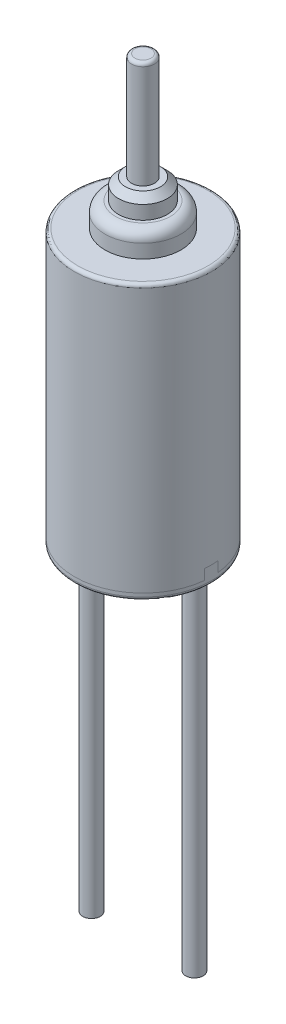
ISO-10303-21;
HEADER;
FILE_DESCRIPTION(('STEP AP214'),'2;1');
FILE_NAME('part.step','',(''),(''),'','','');
FILE_SCHEMA(('AUTOMOTIVE_DESIGN { 1 0 10303 214 1 1 1 1 }'));
ENDSEC;
DATA;
#1=APPLICATION_CONTEXT('core data for automotive mechanical design processes');
#2=APPLICATION_PROTOCOL_DEFINITION('international standard','automotive_design',2000,#1);
#3=PRODUCT_CONTEXT('',#1,'mechanical');
#4=PRODUCT('Part','Part','',(#3));
#5=PRODUCT_RELATED_PRODUCT_CATEGORY('part','',(#4));
#6=PRODUCT_DEFINITION_FORMATION('','',#4);
#7=PRODUCT_DEFINITION_CONTEXT('part definition',#1,'design');
#8=PRODUCT_DEFINITION('design','',#6,#7);
#9=PRODUCT_DEFINITION_SHAPE('','',#8);
#10=(LENGTH_UNIT() NAMED_UNIT(*) SI_UNIT(.MILLI.,.METRE.));
#11=(NAMED_UNIT(*) PLANE_ANGLE_UNIT() SI_UNIT($,.RADIAN.));
#12=(NAMED_UNIT(*) SI_UNIT($,.STERADIAN.) SOLID_ANGLE_UNIT());
#13=UNCERTAINTY_MEASURE_WITH_UNIT(LENGTH_MEASURE(1.E-05),#10,'distance_accuracy_value','');
#14=(GEOMETRIC_REPRESENTATION_CONTEXT(3) GLOBAL_UNCERTAINTY_ASSIGNED_CONTEXT((#13)) GLOBAL_UNIT_ASSIGNED_CONTEXT((#10,
#11,#12)) REPRESENTATION_CONTEXT('',''));
#15=CARTESIAN_POINT('',(0.,0.,0.));
#16=DIRECTION('',(0.,0.,1.));
#17=DIRECTION('',(1.,0.,0.));
#18=AXIS2_PLACEMENT_3D('',#15,#16,#17);
#19=CARTESIAN_POINT('',(1.5,-10.,0.));
#20=DIRECTION('',(0.,1.,0.));
#21=DIRECTION('',(0.,0.,1.));
#22=AXIS2_PLACEMENT_3D('',#19,#20,#21);
#23=CYLINDRICAL_SURFACE('',#22,0.255);
#24=CARTESIAN_POINT('',(1.5,-10.,0.));
#25=DIRECTION('',(0.,-1.,0.));
#26=DIRECTION('',(0.,0.,1.));
#27=AXIS2_PLACEMENT_3D('',#24,#25,#26);
#28=CIRCLE('',#27,0.255);
#29=CARTESIAN_POINT('',(1.5,-10.,0.255));
#30=VERTEX_POINT('',#29);
#31=EDGE_CURVE('E11',#30,#30,#28,.T.);
#32=ORIENTED_EDGE('',*,*,#31,.F.);
#33=EDGE_LOOP('',(#32));
#34=FACE_BOUND('',#33,.T.);
#35=CARTESIAN_POINT('',(1.5,0.,0.));
#36=DIRECTION('',(0.,-1.,0.));
#37=DIRECTION('',(0.,0.,1.));
#38=AXIS2_PLACEMENT_3D('',#35,#36,#37);
#39=CIRCLE('',#38,0.255);
#40=CARTESIAN_POINT('',(1.5,0.,0.255));
#41=VERTEX_POINT('',#40);
#42=EDGE_CURVE('E50',#41,#41,#39,.T.);
#43=ORIENTED_EDGE('',*,*,#42,.T.);
#44=EDGE_LOOP('',(#43));
#45=FACE_BOUND('',#44,.T.);
#46=ADVANCED_FACE('F47',(#34,#45),#23,.T.);
#47=CARTESIAN_POINT('',(1.5,-10.,0.));
#48=DIRECTION('',(0.,1.,0.));
#49=DIRECTION('',(0.,0.,1.));
#50=AXIS2_PLACEMENT_3D('',#47,#48,#49);
#51=PLANE('',#50);
#52=ORIENTED_EDGE('',*,*,#31,.T.);
#53=EDGE_LOOP('',(#52));
#54=FACE_BOUND('',#53,.T.);
#55=ADVANCED_FACE('F62',(#54),#51,.F.);
#56=CARTESIAN_POINT('',(1.5,0.,0.));
#57=DIRECTION('',(0.,1.,0.));
#58=DIRECTION('',(0.,0.,1.));
#59=AXIS2_PLACEMENT_3D('',#56,#57,#58);
#60=PLANE('',#59);
#61=ORIENTED_EDGE('',*,*,#42,.F.);
#62=EDGE_LOOP('',(#61));
#63=FACE_BOUND('',#62,.T.);
#64=ADVANCED_FACE('F60',(#63),#60,.T.);
#65=CLOSED_SHELL('',(#46,#55,#64));
#66=MANIFOLD_SOLID_BREP('B2',#65);
#67=CARTESIAN_POINT('',(-1.5,-10.,0.));
#68=DIRECTION('',(0.,1.,0.));
#69=DIRECTION('',(0.,0.,1.));
#70=AXIS2_PLACEMENT_3D('',#67,#68,#69);
#71=CYLINDRICAL_SURFACE('',#70,0.255);
#72=CARTESIAN_POINT('',(-1.5,-10.,0.));
#73=DIRECTION('',(0.,-1.,0.));
#74=DIRECTION('',(0.,0.,-1.));
#75=AXIS2_PLACEMENT_3D('',#72,#73,#74);
#76=CIRCLE('',#75,0.255);
#77=CARTESIAN_POINT('',(-1.5,-10.,-0.255));
#78=VERTEX_POINT('',#77);
#79=EDGE_CURVE('E46',#78,#78,#76,.T.);
#80=ORIENTED_EDGE('',*,*,#79,.F.);
#81=EDGE_LOOP('',(#80));
#82=FACE_BOUND('',#81,.T.);
#83=CARTESIAN_POINT('',(-1.5,0.,0.));
#84=DIRECTION('',(0.,-1.,0.));
#85=DIRECTION('',(0.,0.,-1.));
#86=AXIS2_PLACEMENT_3D('',#83,#84,#85);
#87=CIRCLE('',#86,0.255);
#88=CARTESIAN_POINT('',(-1.5,0.,-0.255));
#89=VERTEX_POINT('',#88);
#90=EDGE_CURVE('E118',#89,#89,#87,.T.);
#91=ORIENTED_EDGE('',*,*,#90,.T.);
#92=EDGE_LOOP('',(#91));
#93=FACE_BOUND('',#92,.T.);
#94=ADVANCED_FACE('F115',(#82,#93),#71,.T.);
#95=CARTESIAN_POINT('',(-1.5,-10.,0.));
#96=DIRECTION('',(0.,-1.,0.));
#97=DIRECTION('',(0.,0.,-1.));
#98=AXIS2_PLACEMENT_3D('',#95,#96,#97);
#99=PLANE('',#98);
#100=ORIENTED_EDGE('',*,*,#79,.T.);
#101=EDGE_LOOP('',(#100));
#102=FACE_BOUND('',#101,.T.);
#103=ADVANCED_FACE('F130',(#102),#99,.T.);
#104=CARTESIAN_POINT('',(-1.5,0.,0.));
#105=DIRECTION('',(0.,-1.,0.));
#106=DIRECTION('',(0.,0.,-1.));
#107=AXIS2_PLACEMENT_3D('',#104,#105,#106);
#108=PLANE('',#107);
#109=ORIENTED_EDGE('',*,*,#90,.F.);
#110=EDGE_LOOP('',(#109));
#111=FACE_BOUND('',#110,.T.);
#112=ADVANCED_FACE('F128',(#111),#108,.F.);
#113=CLOSED_SHELL('',(#94,#103,#112));
#114=MANIFOLD_SOLID_BREP('B6',#113);
#115=CARTESIAN_POINT('',(-2.01,0.2,-2.));
#116=DIRECTION('',(0.,1.,0.));
#117=DIRECTION('',(0.,0.,1.));
#118=AXIS2_PLACEMENT_3D('',#115,#116,#117);
#119=PLANE('',#118);
#120=DIRECTION('',(1.,0.,0.));
#121=VECTOR('',#120,1.);
#122=CARTESIAN_POINT('',(-2.01,0.2,-0.2));
#123=LINE('',#122,#121);
#124=CARTESIAN_POINT('',(-1.98997487421324,0.2,-0.2));
#125=VERTEX_POINT('',#124);
#126=CARTESIAN_POINT('',(1.98997487421324,0.2,-0.2));
#127=VERTEX_POINT('',#126);
#128=EDGE_CURVE('E198',#125,#127,#123,.T.);
#129=ORIENTED_EDGE('',*,*,#128,.T.);
#130=CARTESIAN_POINT('',(0.,0.2,0.));
#131=DIRECTION('',(0.,1.,0.));
#132=DIRECTION('',(0.,0.,1.));
#133=AXIS2_PLACEMENT_3D('',#130,#131,#132);
#134=CIRCLE('',#133,2.);
#135=EDGE_CURVE('E253',#127,#125,#134,.T.);
#136=ORIENTED_EDGE('',*,*,#135,.T.);
#137=EDGE_LOOP('',(#129,#136));
#138=FACE_BOUND('',#137,.T.);
#139=ADVANCED_FACE('F183',(#138),#119,.T.);
#140=CARTESIAN_POINT('',(-2.01,0.2,-0.2));
#141=DIRECTION('',(0.,0.,-1.));
#142=DIRECTION('',(0.,1.,0.));
#143=AXIS2_PLACEMENT_3D('',#140,#141,#142);
#144=PLANE('',#143);
#145=DIRECTION('',(1.,0.,0.));
#146=VECTOR('',#145,1.);
#147=CARTESIAN_POINT('',(-2.01,0.5,-0.2));
#148=LINE('',#147,#146);
#149=CARTESIAN_POINT('',(-1.98997487421324,0.5,-0.199999999999997));
#150=VERTEX_POINT('',#149);
#151=CARTESIAN_POINT('',(1.98997487421324,0.5,-0.199999999999997));
#152=VERTEX_POINT('',#151);
#153=EDGE_CURVE('E257',#150,#152,#148,.T.);
#154=ORIENTED_EDGE('',*,*,#153,.T.);
#155=DIRECTION('',(0.,-1.,0.));
#156=VECTOR('',#155,1.);
#157=CARTESIAN_POINT('',(1.98997487421324,8.,-0.199999999999997));
#158=LINE('',#157,#156);
#159=EDGE_CURVE('E249',#152,#127,#158,.T.);
#160=ORIENTED_EDGE('',*,*,#159,.T.);
#161=ORIENTED_EDGE('',*,*,#128,.F.);
#162=DIRECTION('',(0.,-1.,0.));
#163=VECTOR('',#162,1.);
#164=CARTESIAN_POINT('',(-1.98997487421324,8.,-0.199999999999997));
#165=LINE('',#164,#163);
#166=EDGE_CURVE('E251',#125,#150,#165,.F.);
#167=ORIENTED_EDGE('',*,*,#166,.T.);
#168=EDGE_LOOP('',(#154,#160,#161,#167));
#169=FACE_BOUND('',#168,.T.);
#170=ADVANCED_FACE('F265',(#169),#144,.T.);
#171=CARTESIAN_POINT('',(-2.01,0.5,0.2));
#172=DIRECTION('',(0.,1.,0.));
#173=DIRECTION('',(0.,0.,1.));
#174=AXIS2_PLACEMENT_3D('',#171,#172,#173);
#175=PLANE('',#174);
#176=DIRECTION('',(1.,0.,0.));
#177=VECTOR('',#176,1.);
#178=CARTESIAN_POINT('',(-2.01,0.5,0.2));
#179=LINE('',#178,#177);
#180=CARTESIAN_POINT('',(-1.98997487421324,0.5,0.2));
#181=VERTEX_POINT('',#180);
#182=CARTESIAN_POINT('',(1.98997487421324,0.5,0.2));
#183=VERTEX_POINT('',#182);
#184=EDGE_CURVE('E230',#181,#183,#179,.T.);
#185=ORIENTED_EDGE('',*,*,#184,.T.);
#186=CARTESIAN_POINT('',(0.,0.5,0.));
#187=DIRECTION('',(0.,1.,0.));
#188=DIRECTION('',(0.,0.,1.));
#189=AXIS2_PLACEMENT_3D('',#186,#187,#188);
#190=CIRCLE('',#189,2.);
#191=EDGE_CURVE('E246',#183,#152,#190,.T.);
#192=ORIENTED_EDGE('',*,*,#191,.T.);
#193=ORIENTED_EDGE('',*,*,#153,.F.);
#194=EDGE_CURVE('E247',#150,#181,#190,.T.);
#195=ORIENTED_EDGE('',*,*,#194,.T.);
#196=EDGE_LOOP('',(#185,#192,#193,#195));
#197=FACE_BOUND('',#196,.T.);
#198=ADVANCED_FACE('F262',(#197),#175,.T.);
#199=CARTESIAN_POINT('',(-2.01,0.2,0.2));
#200=DIRECTION('',(0.,0.,1.));
#201=DIRECTION('',(0.,-1.,0.));
#202=AXIS2_PLACEMENT_3D('',#199,#200,#201);
#203=PLANE('',#202);
#204=ORIENTED_EDGE('',*,*,#184,.F.);
#205=DIRECTION('',(0.,-1.,0.));
#206=VECTOR('',#205,1.);
#207=CARTESIAN_POINT('',(-1.98997487421324,8.,0.199999999999999));
#208=LINE('',#207,#206);
#209=CARTESIAN_POINT('',(-1.98997487421324,0.2,0.199999999999999));
#210=VERTEX_POINT('',#209);
#211=EDGE_CURVE('E233',#181,#210,#208,.T.);
#212=ORIENTED_EDGE('',*,*,#211,.T.);
#213=DIRECTION('',(1.,0.,0.));
#214=VECTOR('',#213,1.);
#215=CARTESIAN_POINT('',(-2.01,0.2,0.2));
#216=LINE('',#215,#214);
#217=CARTESIAN_POINT('',(1.98997487421324,0.2,0.199999999999999));
#218=VERTEX_POINT('',#217);
#219=EDGE_CURVE('E222',#210,#218,#216,.T.);
#220=ORIENTED_EDGE('',*,*,#219,.T.);
#221=DIRECTION('',(0.,-1.,0.));
#222=VECTOR('',#221,1.);
#223=CARTESIAN_POINT('',(1.98997487421324,8.,0.199999999999999));
#224=LINE('',#223,#222);
#225=EDGE_CURVE('E238',#218,#183,#224,.F.);
#226=ORIENTED_EDGE('',*,*,#225,.T.);
#227=EDGE_LOOP('',(#204,#212,#220,#226));
#228=FACE_BOUND('',#227,.T.);
#229=ADVANCED_FACE('F234',(#228),#203,.T.);
#230=CARTESIAN_POINT('',(-2.01,0.2,2.));
#231=DIRECTION('',(0.,1.,0.));
#232=DIRECTION('',(0.,0.,1.));
#233=AXIS2_PLACEMENT_3D('',#230,#231,#232);
#234=PLANE('',#233);
#235=CARTESIAN_POINT('',(0.,0.2,0.));
#236=DIRECTION('',(0.,1.,0.));
#237=DIRECTION('',(0.,0.,1.));
#238=AXIS2_PLACEMENT_3D('',#235,#236,#237);
#239=CIRCLE('',#238,2.);
#240=EDGE_CURVE('E226',#210,#218,#239,.T.);
#241=ORIENTED_EDGE('',*,*,#240,.T.);
#242=ORIENTED_EDGE('',*,*,#219,.F.);
#243=EDGE_LOOP('',(#241,#242));
#244=FACE_BOUND('',#243,.T.);
#245=ADVANCED_FACE('F224',(#244),#234,.T.);
#246=CARTESIAN_POINT('',(0.,8.,0.));
#247=DIRECTION('',(0.,-1.,0.));
#248=DIRECTION('',(0.,0.,-1.));
#249=AXIS2_PLACEMENT_3D('',#246,#247,#248);
#250=CYLINDRICAL_SURFACE('',#249,2.);
#251=CARTESIAN_POINT('',(0.,0.0999999999999994,0.));
#252=DIRECTION('',(0.,1.,0.));
#253=DIRECTION('',(0.,0.,1.));
#254=AXIS2_PLACEMENT_3D('',#251,#252,#253);
#255=CIRCLE('',#254,2.);
#256=CARTESIAN_POINT('',(0.,0.0999999999999994,2.));
#257=VERTEX_POINT('',#256);
#258=EDGE_CURVE('E191',#257,#257,#255,.T.);
#259=ORIENTED_EDGE('',*,*,#258,.T.);
#260=EDGE_LOOP('',(#259));
#261=FACE_BOUND('',#260,.T.);
#262=ORIENTED_EDGE('',*,*,#225,.F.);
#263=ORIENTED_EDGE('',*,*,#240,.F.);
#264=ORIENTED_EDGE('',*,*,#211,.F.);
#265=ORIENTED_EDGE('',*,*,#194,.F.);
#266=ORIENTED_EDGE('',*,*,#166,.F.);
#267=ORIENTED_EDGE('',*,*,#135,.F.);
#268=ORIENTED_EDGE('',*,*,#159,.F.);
#269=ORIENTED_EDGE('',*,*,#191,.F.);
#270=EDGE_LOOP('',(#262,#263,#264,#265,#266,#267,#268,#269));
#271=FACE_BOUND('',#270,.T.);
#272=ADVANCED_FACE('F240',(#261,#271),#250,.T.);
#273=CARTESIAN_POINT('',(0.,0.,0.));
#274=DIRECTION('',(0.,1.,0.));
#275=DIRECTION('',(0.,0.,1.));
#276=AXIS2_PLACEMENT_3D('',#273,#274,#275);
#277=PLANE('',#276);
#278=CARTESIAN_POINT('',(0.,0.,0.));
#279=DIRECTION('',(0.,1.,0.));
#280=DIRECTION('',(0.,0.,1.));
#281=AXIS2_PLACEMENT_3D('',#278,#279,#280);
#282=CIRCLE('',#281,1.9);
#283=CARTESIAN_POINT('',(0.,0.,1.9));
#284=VERTEX_POINT('',#283);
#285=EDGE_CURVE('E113',#284,#284,#282,.F.);
#286=ORIENTED_EDGE('',*,*,#285,.T.);
#287=EDGE_LOOP('',(#286));
#288=FACE_BOUND('',#287,.T.);
#289=ADVANCED_FACE('F275',(#288),#277,.F.);
#290=CARTESIAN_POINT('',(0.,0.0999999999999994,0.));
#291=DIRECTION('',(0.,1.,0.));
#292=DIRECTION('',(0.,0.,1.));
#293=AXIS2_PLACEMENT_3D('',#290,#291,#292);
#294=TOROIDAL_SURFACE('',#293,1.9,0.1);
#295=ORIENTED_EDGE('',*,*,#285,.F.);
#296=EDGE_LOOP('',(#295));
#297=FACE_BOUND('',#296,.T.);
#298=ORIENTED_EDGE('',*,*,#258,.F.);
#299=EDGE_LOOP('',(#298));
#300=FACE_BOUND('',#299,.T.);
#301=ADVANCED_FACE('F185',(#297,#300),#294,.T.);
#302=CLOSED_SHELL('',(#139,#170,#198,#229,#245,#272,#289,#301));
#303=MANIFOLD_SOLID_BREP('B41',#302);
#304=CARTESIAN_POINT('',(-2.01,0.2,-2.));
#305=DIRECTION('',(0.,1.,0.));
#306=DIRECTION('',(0.,0.,1.));
#307=AXIS2_PLACEMENT_3D('',#304,#305,#306);
#308=PLANE('',#307);
#309=DIRECTION('',(1.,0.,0.));
#310=VECTOR('',#309,1.);
#311=CARTESIAN_POINT('',(-2.01,0.2,-0.2));
#312=LINE('',#311,#310);
#313=CARTESIAN_POINT('',(-1.98997487421324,0.2,-0.2));
#314=VERTEX_POINT('',#313);
#315=CARTESIAN_POINT('',(1.98997487421324,0.2,-0.2));
#316=VERTEX_POINT('',#315);
#317=EDGE_CURVE('E403',#314,#316,#312,.T.);
#318=ORIENTED_EDGE('',*,*,#317,.F.);
#319=CARTESIAN_POINT('',(0.,0.2,0.));
#320=DIRECTION('',(0.,1.,0.));
#321=DIRECTION('',(0.,0.,1.));
#322=AXIS2_PLACEMENT_3D('',#319,#320,#321);
#323=CIRCLE('',#322,2.);
#324=EDGE_CURVE('E358',#316,#314,#323,.T.);
#325=ORIENTED_EDGE('',*,*,#324,.F.);
#326=EDGE_LOOP('',(#318,#325));
#327=FACE_BOUND('',#326,.T.);
#328=ADVANCED_FACE('F343',(#327),#308,.F.);
#329=CARTESIAN_POINT('',(-2.01,0.2,-0.2));
#330=DIRECTION('',(0.,0.,-1.));
#331=DIRECTION('',(0.,1.,0.));
#332=AXIS2_PLACEMENT_3D('',#329,#330,#331);
#333=PLANE('',#332);
#334=DIRECTION('',(1.,0.,0.));
#335=VECTOR('',#334,1.);
#336=CARTESIAN_POINT('',(-2.01,0.5,-0.2));
#337=LINE('',#336,#335);
#338=CARTESIAN_POINT('',(-1.98997487421324,0.5,-0.199999999999997));
#339=VERTEX_POINT('',#338);
#340=CARTESIAN_POINT('',(1.98997487421324,0.5,-0.199999999999997));
#341=VERTEX_POINT('',#340);
#342=EDGE_CURVE('E407',#339,#341,#337,.T.);
#343=ORIENTED_EDGE('',*,*,#342,.F.);
#344=DIRECTION('',(0.,-1.,0.));
#345=VECTOR('',#344,1.);
#346=CARTESIAN_POINT('',(-1.98997487421324,8.,-0.199999999999997));
#347=LINE('',#346,#345);
#348=EDGE_CURVE('E467',#314,#339,#347,.F.);
#349=ORIENTED_EDGE('',*,*,#348,.F.);
#350=ORIENTED_EDGE('',*,*,#317,.T.);
#351=DIRECTION('',(0.,-1.,0.));
#352=VECTOR('',#351,1.);
#353=CARTESIAN_POINT('',(1.98997487421324,8.,-0.199999999999997));
#354=LINE('',#353,#352);
#355=EDGE_CURVE('E471',#341,#316,#354,.T.);
#356=ORIENTED_EDGE('',*,*,#355,.F.);
#357=EDGE_LOOP('',(#343,#349,#350,#356));
#358=FACE_BOUND('',#357,.T.);
#359=ADVANCED_FACE('F429',(#358),#333,.F.);
#360=CARTESIAN_POINT('',(-2.01,0.5,0.2));
#361=DIRECTION('',(0.,1.,0.));
#362=DIRECTION('',(0.,0.,1.));
#363=AXIS2_PLACEMENT_3D('',#360,#361,#362);
#364=PLANE('',#363);
#365=DIRECTION('',(1.,0.,0.));
#366=VECTOR('',#365,1.);
#367=CARTESIAN_POINT('',(-2.01,0.5,0.2));
#368=LINE('',#367,#366);
#369=CARTESIAN_POINT('',(-1.98997487421324,0.5,0.2));
#370=VERTEX_POINT('',#369);
#371=CARTESIAN_POINT('',(1.98997487421324,0.5,0.2));
#372=VERTEX_POINT('',#371);
#373=EDGE_CURVE('E397',#370,#372,#368,.T.);
#374=ORIENTED_EDGE('',*,*,#373,.F.);
#375=CARTESIAN_POINT('',(0.,0.5,0.));
#376=DIRECTION('',(0.,1.,0.));
#377=DIRECTION('',(0.,0.,1.));
#378=AXIS2_PLACEMENT_3D('',#375,#376,#377);
#379=CIRCLE('',#378,2.);
#380=EDGE_CURVE('E387',#339,#370,#379,.T.);
#381=ORIENTED_EDGE('',*,*,#380,.F.);
#382=ORIENTED_EDGE('',*,*,#342,.T.);
#383=EDGE_CURVE('E473',#372,#341,#379,.T.);
#384=ORIENTED_EDGE('',*,*,#383,.F.);
#385=EDGE_LOOP('',(#374,#381,#382,#384));
#386=FACE_BOUND('',#385,.T.);
#387=ADVANCED_FACE('F434',(#386),#364,.F.);
#388=CARTESIAN_POINT('',(-2.01,0.2,0.2));
#389=DIRECTION('',(0.,0.,1.));
#390=DIRECTION('',(0.,-1.,0.));
#391=AXIS2_PLACEMENT_3D('',#388,#389,#390);
#392=PLANE('',#391);
#393=ORIENTED_EDGE('',*,*,#373,.T.);
#394=DIRECTION('',(0.,-1.,0.));
#395=VECTOR('',#394,1.);
#396=CARTESIAN_POINT('',(1.98997487421324,8.,0.199999999999999));
#397=LINE('',#396,#395);
#398=CARTESIAN_POINT('',(1.98997487421324,0.2,0.199999999999999));
#399=VERTEX_POINT('',#398);
#400=EDGE_CURVE('E391',#399,#372,#397,.F.);
#401=ORIENTED_EDGE('',*,*,#400,.F.);
#402=DIRECTION('',(1.,0.,0.));
#403=VECTOR('',#402,1.);
#404=CARTESIAN_POINT('',(-2.01,0.2,0.2));
#405=LINE('',#404,#403);
#406=CARTESIAN_POINT('',(-1.98997487421324,0.2,0.199999999999999));
#407=VERTEX_POINT('',#406);
#408=EDGE_CURVE('E394',#407,#399,#405,.T.);
#409=ORIENTED_EDGE('',*,*,#408,.F.);
#410=DIRECTION('',(0.,-1.,0.));
#411=VECTOR('',#410,1.);
#412=CARTESIAN_POINT('',(-1.98997487421324,8.,0.199999999999999));
#413=LINE('',#412,#411);
#414=EDGE_CURVE('E380',#370,#407,#413,.T.);
#415=ORIENTED_EDGE('',*,*,#414,.F.);
#416=EDGE_LOOP('',(#393,#401,#409,#415));
#417=FACE_BOUND('',#416,.T.);
#418=ADVANCED_FACE('F395',(#417),#392,.F.);
#419=CARTESIAN_POINT('',(-2.01,0.2,2.));
#420=DIRECTION('',(0.,1.,0.));
#421=DIRECTION('',(0.,0.,1.));
#422=AXIS2_PLACEMENT_3D('',#419,#420,#421);
#423=PLANE('',#422);
#424=CARTESIAN_POINT('',(0.,0.2,0.));
#425=DIRECTION('',(0.,1.,0.));
#426=DIRECTION('',(0.,0.,1.));
#427=AXIS2_PLACEMENT_3D('',#424,#425,#426);
#428=CIRCLE('',#427,2.);
#429=EDGE_CURVE('E385',#407,#399,#428,.T.);
#430=ORIENTED_EDGE('',*,*,#429,.F.);
#431=ORIENTED_EDGE('',*,*,#408,.T.);
#432=EDGE_LOOP('',(#430,#431));
#433=FACE_BOUND('',#432,.T.);
#434=ADVANCED_FACE('F399',(#433),#423,.F.);
#435=CARTESIAN_POINT('',(0.,8.7,0.));
#436=DIRECTION('',(0.,1.,0.));
#437=DIRECTION('',(0.,0.,1.));
#438=AXIS2_PLACEMENT_3D('',#435,#436,#437);
#439=PLANE('',#438);
#440=CARTESIAN_POINT('',(0.,8.7,0.));
#441=DIRECTION('',(0.,1.,0.));
#442=DIRECTION('',(0.,0.,1.));
#443=AXIS2_PLACEMENT_3D('',#440,#441,#442);
#444=CIRCLE('',#443,0.805);
#445=CARTESIAN_POINT('',(0.,8.7,0.805));
#446=VERTEX_POINT('',#445);
#447=EDGE_CURVE('E351',#446,#446,#444,.T.);
#448=ORIENTED_EDGE('',*,*,#447,.T.);
#449=EDGE_LOOP('',(#448));
#450=FACE_BOUND('',#449,.T.);
#451=ADVANCED_FACE('F418',(#450),#439,.T.);
#452=CARTESIAN_POINT('',(0.,8.7,0.));
#453=DIRECTION('',(0.,-1.,0.));
#454=DIRECTION('',(0.,0.,-1.));
#455=AXIS2_PLACEMENT_3D('',#452,#453,#454);
#456=CYLINDRICAL_SURFACE('',#455,1.105);
#457=CARTESIAN_POINT('',(0.,8.4,0.));
#458=DIRECTION('',(0.,1.,0.));
#459=DIRECTION('',(0.,0.,1.));
#460=AXIS2_PLACEMENT_3D('',#457,#458,#459);
#461=CIRCLE('',#460,1.105);
#462=CARTESIAN_POINT('',(0.,8.4,1.105));
#463=VERTEX_POINT('',#462);
#464=EDGE_CURVE('E181',#463,#463,#461,.F.);
#465=ORIENTED_EDGE('',*,*,#464,.T.);
#466=EDGE_LOOP('',(#465));
#467=FACE_BOUND('',#466,.T.);
#468=CARTESIAN_POINT('',(0.,8.,0.));
#469=DIRECTION('',(0.,1.,0.));
#470=DIRECTION('',(0.,0.,1.));
#471=AXIS2_PLACEMENT_3D('',#468,#469,#470);
#472=CIRCLE('',#471,1.105);
#473=CARTESIAN_POINT('',(0.,8.,1.105));
#474=VERTEX_POINT('',#473);
#475=EDGE_CURVE('E464',#474,#474,#472,.T.);
#476=ORIENTED_EDGE('',*,*,#475,.T.);
#477=EDGE_LOOP('',(#476));
#478=FACE_BOUND('',#477,.T.);
#479=ADVANCED_FACE('F449',(#467,#478),#456,.T.);
#480=CARTESIAN_POINT('',(0.,8.,0.));
#481=DIRECTION('',(0.,1.,0.));
#482=DIRECTION('',(0.,0.,1.));
#483=AXIS2_PLACEMENT_3D('',#480,#481,#482);
#484=PLANE('',#483);
#485=CARTESIAN_POINT('',(0.,8.,0.));
#486=DIRECTION('',(0.,1.,0.));
#487=DIRECTION('',(0.,0.,1.));
#488=AXIS2_PLACEMENT_3D('',#485,#486,#487);
#489=CIRCLE('',#488,1.9);
#490=CARTESIAN_POINT('',(0.,8.,1.9));
#491=VERTEX_POINT('',#490);
#492=EDGE_CURVE('E406',#491,#491,#489,.T.);
#493=ORIENTED_EDGE('',*,*,#492,.T.);
#494=EDGE_LOOP('',(#493));
#495=FACE_BOUND('',#494,.T.);
#496=ORIENTED_EDGE('',*,*,#475,.F.);
#497=EDGE_LOOP('',(#496));
#498=FACE_BOUND('',#497,.T.);
#499=ADVANCED_FACE('F452',(#495,#498),#484,.T.);
#500=CARTESIAN_POINT('',(0.,8.,0.));
#501=DIRECTION('',(0.,-1.,0.));
#502=DIRECTION('',(0.,0.,-1.));
#503=AXIS2_PLACEMENT_3D('',#500,#501,#502);
#504=CYLINDRICAL_SURFACE('',#503,2.);
#505=CARTESIAN_POINT('',(0.,7.9,0.));
#506=DIRECTION('',(0.,1.,0.));
#507=DIRECTION('',(0.,0.,1.));
#508=AXIS2_PLACEMENT_3D('',#505,#506,#507);
#509=CIRCLE('',#508,2.);
#510=CARTESIAN_POINT('',(0.,7.9,2.));
#511=VERTEX_POINT('',#510);
#512=EDGE_CURVE('E413',#511,#511,#509,.F.);
#513=ORIENTED_EDGE('',*,*,#512,.T.);
#514=EDGE_LOOP('',(#513));
#515=FACE_BOUND('',#514,.T.);
#516=ORIENTED_EDGE('',*,*,#429,.T.);
#517=ORIENTED_EDGE('',*,*,#400,.T.);
#518=ORIENTED_EDGE('',*,*,#383,.T.);
#519=ORIENTED_EDGE('',*,*,#355,.T.);
#520=ORIENTED_EDGE('',*,*,#324,.T.);
#521=ORIENTED_EDGE('',*,*,#348,.T.);
#522=ORIENTED_EDGE('',*,*,#380,.T.);
#523=ORIENTED_EDGE('',*,*,#414,.T.);
#524=EDGE_LOOP('',(#516,#517,#518,#519,#520,#521,#522,#523));
#525=FACE_BOUND('',#524,.T.);
#526=ADVANCED_FACE('F382',(#515,#525),#504,.T.);
#527=CARTESIAN_POINT('',(0.,7.9,0.));
#528=DIRECTION('',(0.,1.,0.));
#529=DIRECTION('',(0.,0.,1.));
#530=AXIS2_PLACEMENT_3D('',#527,#528,#529);
#531=TOROIDAL_SURFACE('',#530,1.9,0.1);
#532=ORIENTED_EDGE('',*,*,#512,.F.);
#533=EDGE_LOOP('',(#532));
#534=FACE_BOUND('',#533,.T.);
#535=ORIENTED_EDGE('',*,*,#492,.F.);
#536=EDGE_LOOP('',(#535));
#537=FACE_BOUND('',#536,.T.);
#538=ADVANCED_FACE('F421',(#534,#537),#531,.T.);
#539=CARTESIAN_POINT('',(0.,8.4,0.));
#540=DIRECTION('',(0.,1.,0.));
#541=DIRECTION('',(0.,0.,1.));
#542=AXIS2_PLACEMENT_3D('',#539,#540,#541);
#543=TOROIDAL_SURFACE('',#542,0.805,0.3);
#544=ORIENTED_EDGE('',*,*,#464,.F.);
#545=EDGE_LOOP('',(#544));
#546=FACE_BOUND('',#545,.T.);
#547=ORIENTED_EDGE('',*,*,#447,.F.);
#548=EDGE_LOOP('',(#547));
#549=FACE_BOUND('',#548,.T.);
#550=ADVANCED_FACE('F345',(#546,#549),#543,.T.);
#551=CLOSED_SHELL('',(#328,#359,#387,#418,#434,#451,#479,#499,#526,#538,#550));
#552=MANIFOLD_SOLID_BREP('B107',#551);
#553=CARTESIAN_POINT('',(0.,12.41,0.));
#554=DIRECTION('',(0.,-1.,0.));
#555=DIRECTION('',(0.,0.,-1.));
#556=AXIS2_PLACEMENT_3D('',#553,#554,#555);
#557=CYLINDRICAL_SURFACE('',#556,0.335);
#558=CARTESIAN_POINT('',(0.,12.31,0.));
#559=DIRECTION('',(0.,1.,0.));
#560=DIRECTION('',(0.,0.,1.));
#561=AXIS2_PLACEMENT_3D('',#558,#559,#560);
#562=CIRCLE('',#561,0.335);
#563=CARTESIAN_POINT('',(0.,12.31,0.335));
#564=VERTEX_POINT('',#563);
#565=EDGE_CURVE('E342',#564,#564,#562,.F.);
#566=ORIENTED_EDGE('',*,*,#565,.T.);
#567=EDGE_LOOP('',(#566));
#568=FACE_BOUND('',#567,.T.);
#569=CARTESIAN_POINT('',(0.,9.3,0.));
#570=DIRECTION('',(0.,1.,0.));
#571=DIRECTION('',(0.,0.,1.));
#572=AXIS2_PLACEMENT_3D('',#569,#570,#571);
#573=CIRCLE('',#572,0.335);
#574=CARTESIAN_POINT('',(0.,9.3,0.335));
#575=VERTEX_POINT('',#574);
#576=EDGE_CURVE('E558',#575,#575,#573,.T.);
#577=ORIENTED_EDGE('',*,*,#576,.T.);
#578=EDGE_LOOP('',(#577));
#579=FACE_BOUND('',#578,.T.);
#580=ADVANCED_FACE('F547',(#568,#579),#557,.T.);
#581=CARTESIAN_POINT('',(0.,12.41,0.));
#582=DIRECTION('',(0.,1.,0.));
#583=DIRECTION('',(0.,0.,1.));
#584=AXIS2_PLACEMENT_3D('',#581,#582,#583);
#585=PLANE('',#584);
#586=CARTESIAN_POINT('',(0.,12.41,0.));
#587=DIRECTION('',(0.,1.,0.));
#588=DIRECTION('',(0.,0.,1.));
#589=AXIS2_PLACEMENT_3D('',#586,#587,#588);
#590=CIRCLE('',#589,0.235);
#591=CARTESIAN_POINT('',(0.,12.41,0.235));
#592=VERTEX_POINT('',#591);
#593=EDGE_CURVE('E554',#592,#592,#590,.T.);
#594=ORIENTED_EDGE('',*,*,#593,.T.);
#595=EDGE_LOOP('',(#594));
#596=FACE_BOUND('',#595,.T.);
#597=ADVANCED_FACE('F568',(#596),#585,.T.);
#598=CARTESIAN_POINT('',(0.,9.3,0.));
#599=DIRECTION('',(0.,1.,0.));
#600=DIRECTION('',(0.,0.,1.));
#601=AXIS2_PLACEMENT_3D('',#598,#599,#600);
#602=PLANE('',#601);
#603=ORIENTED_EDGE('',*,*,#576,.F.);
#604=EDGE_LOOP('',(#603));
#605=FACE_BOUND('',#604,.T.);
#606=ADVANCED_FACE('F566',(#605),#602,.F.);
#607=CARTESIAN_POINT('',(0.,12.31,0.));
#608=DIRECTION('',(0.,1.,0.));
#609=DIRECTION('',(0.,0.,1.));
#610=AXIS2_PLACEMENT_3D('',#607,#608,#609);
#611=TOROIDAL_SURFACE('',#610,0.235,0.1);
#612=ORIENTED_EDGE('',*,*,#565,.F.);
#613=EDGE_LOOP('',(#612));
#614=FACE_BOUND('',#613,.T.);
#615=ORIENTED_EDGE('',*,*,#593,.F.);
#616=EDGE_LOOP('',(#615));
#617=FACE_BOUND('',#616,.T.);
#618=ADVANCED_FACE('F549',(#614,#617),#611,.T.);
#619=CLOSED_SHELL('',(#580,#597,#606,#618));
#620=MANIFOLD_SOLID_BREP('B175',#619);
#621=CARTESIAN_POINT('',(0.,9.3,0.));
#622=DIRECTION('',(0.,-1.,0.));
#623=DIRECTION('',(0.,0.,-1.));
#624=AXIS2_PLACEMENT_3D('',#621,#622,#623);
#625=CYLINDRICAL_SURFACE('',#624,0.71);
#626=CARTESIAN_POINT('',(0.,9.1,0.));
#627=DIRECTION('',(0.,1.,0.));
#628=DIRECTION('',(0.,0.,1.));
#629=AXIS2_PLACEMENT_3D('',#626,#627,#628);
#630=CIRCLE('',#629,0.71);
#631=CARTESIAN_POINT('',(0.,9.1,0.71));
#632=VERTEX_POINT('',#631);
#633=EDGE_CURVE('E546',#632,#632,#630,.F.);
#634=ORIENTED_EDGE('',*,*,#633,.T.);
#635=EDGE_LOOP('',(#634));
#636=FACE_BOUND('',#635,.T.);
#637=CARTESIAN_POINT('',(0.,8.7,0.));
#638=DIRECTION('',(0.,1.,0.));
#639=DIRECTION('',(0.,0.,1.));
#640=AXIS2_PLACEMENT_3D('',#637,#638,#639);
#641=CIRCLE('',#640,0.71);
#642=CARTESIAN_POINT('',(0.,8.7,0.71));
#643=VERTEX_POINT('',#642);
#644=EDGE_CURVE('E613',#643,#643,#641,.T.);
#645=ORIENTED_EDGE('',*,*,#644,.T.);
#646=EDGE_LOOP('',(#645));
#647=FACE_BOUND('',#646,.T.);
#648=ADVANCED_FACE('F602',(#636,#647),#625,.T.);
#649=CARTESIAN_POINT('',(0.,9.3,0.));
#650=DIRECTION('',(0.,1.,0.));
#651=DIRECTION('',(0.,0.,1.));
#652=AXIS2_PLACEMENT_3D('',#649,#650,#651);
#653=PLANE('',#652);
#654=CARTESIAN_POINT('',(0.,9.3,0.));
#655=DIRECTION('',(0.,1.,0.));
#656=DIRECTION('',(0.,0.,1.));
#657=AXIS2_PLACEMENT_3D('',#654,#655,#656);
#658=CIRCLE('',#657,0.509999999999999);
#659=CARTESIAN_POINT('',(0.,9.3,0.509999999999999));
#660=VERTEX_POINT('',#659);
#661=EDGE_CURVE('E609',#660,#660,#658,.T.);
#662=ORIENTED_EDGE('',*,*,#661,.T.);
#663=EDGE_LOOP('',(#662));
#664=FACE_BOUND('',#663,.T.);
#665=ADVANCED_FACE('F623',(#664),#653,.T.);
#666=CARTESIAN_POINT('',(0.,8.7,0.));
#667=DIRECTION('',(0.,1.,0.));
#668=DIRECTION('',(0.,0.,1.));
#669=AXIS2_PLACEMENT_3D('',#666,#667,#668);
#670=PLANE('',#669);
#671=ORIENTED_EDGE('',*,*,#644,.F.);
#672=EDGE_LOOP('',(#671));
#673=FACE_BOUND('',#672,.T.);
#674=ADVANCED_FACE('F621',(#673),#670,.F.);
#675=CARTESIAN_POINT('',(0.,9.3,0.));
#676=DIRECTION('',(0.,-1.,0.));
#677=DIRECTION('',(0.,0.,-1.));
#678=AXIS2_PLACEMENT_3D('',#675,#676,#677);
#679=CONICAL_SURFACE('',#678,0.509999999999999,0.785398163397445);
#680=ORIENTED_EDGE('',*,*,#633,.F.);
#681=EDGE_LOOP('',(#680));
#682=FACE_BOUND('',#681,.T.);
#683=ORIENTED_EDGE('',*,*,#661,.F.);
#684=EDGE_LOOP('',(#683));
#685=FACE_BOUND('',#684,.T.);
#686=ADVANCED_FACE('F604',(#682,#685),#679,.T.);
#687=CLOSED_SHELL('',(#648,#665,#674,#686));
#688=MANIFOLD_SOLID_BREP('B337',#687);
#689=ADVANCED_BREP_SHAPE_REPRESENTATION('',(#18,#66,#114,#303,#552,#620,#688),#14);
#690=SHAPE_DEFINITION_REPRESENTATION(#9,#689);
ENDSEC;
END-ISO-10303-21;
